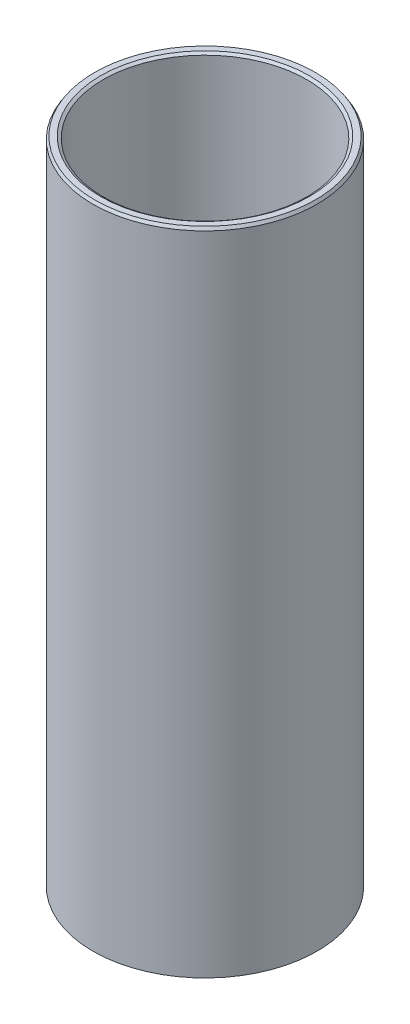
ISO-10303-21;
HEADER;
FILE_DESCRIPTION(('STEP AP214'),'2;1');
FILE_NAME('part.step','',(''),(''),'','','');
FILE_SCHEMA(('AUTOMOTIVE_DESIGN { 1 0 10303 214 1 1 1 1 }'));
ENDSEC;
DATA;
#1=APPLICATION_CONTEXT('core data for automotive mechanical design processes');
#2=APPLICATION_PROTOCOL_DEFINITION('international standard','automotive_design',2000,#1);
#3=PRODUCT_CONTEXT('',#1,'mechanical');
#4=PRODUCT('Part','Part','',(#3));
#5=PRODUCT_RELATED_PRODUCT_CATEGORY('part','',(#4));
#6=PRODUCT_DEFINITION_FORMATION('','',#4);
#7=PRODUCT_DEFINITION_CONTEXT('part definition',#1,'design');
#8=PRODUCT_DEFINITION('design','',#6,#7);
#9=PRODUCT_DEFINITION_SHAPE('','',#8);
#10=(LENGTH_UNIT() NAMED_UNIT(*) SI_UNIT(.MILLI.,.METRE.));
#11=(NAMED_UNIT(*) PLANE_ANGLE_UNIT() SI_UNIT($,.RADIAN.));
#12=(NAMED_UNIT(*) SI_UNIT($,.STERADIAN.) SOLID_ANGLE_UNIT());
#13=UNCERTAINTY_MEASURE_WITH_UNIT(LENGTH_MEASURE(1.E-05),#10,'distance_accuracy_value','');
#14=(GEOMETRIC_REPRESENTATION_CONTEXT(3) GLOBAL_UNCERTAINTY_ASSIGNED_CONTEXT((#13)) GLOBAL_UNIT_ASSIGNED_CONTEXT((#10,
#11,#12)) REPRESENTATION_CONTEXT('',''));
#15=CARTESIAN_POINT('',(0.,0.,0.));
#16=DIRECTION('',(0.,0.,1.));
#17=DIRECTION('',(1.,0.,0.));
#18=AXIS2_PLACEMENT_3D('',#15,#16,#17);
#19=CARTESIAN_POINT('',(0.,319.319546374463,0.));
#20=DIRECTION('',(0.,-1.,0.));
#21=DIRECTION('',(0.,0.,-1.));
#22=AXIS2_PLACEMENT_3D('',#19,#20,#21);
#23=CYLINDRICAL_SURFACE('',#22,55.);
#24=CARTESIAN_POINT('',(0.,0.891832323549224,0.));
#25=DIRECTION('',(0.,1.,0.));
#26=DIRECTION('',(0.,0.,1.));
#27=AXIS2_PLACEMENT_3D('',#24,#25,#26);
#28=CIRCLE('',#27,55.);
#29=CARTESIAN_POINT('',(0.,0.891832323549224,55.));
#30=VERTEX_POINT('',#29);
#31=EDGE_CURVE('E10',#30,#30,#28,.T.);
#32=ORIENTED_EDGE('',*,*,#31,.T.);
#33=EDGE_LOOP('',(#32));
#34=FACE_BOUND('',#33,.T.);
#35=CARTESIAN_POINT('',(0.,317.944861314462,0.));
#36=DIRECTION('',(0.,1.,0.));
#37=DIRECTION('',(0.,0.,1.));
#38=AXIS2_PLACEMENT_3D('',#35,#36,#37);
#39=CIRCLE('',#38,55.);
#40=CARTESIAN_POINT('',(0.,317.944861314462,55.));
#41=VERTEX_POINT('',#40);
#42=EDGE_CURVE('E50',#41,#41,#39,.F.);
#43=ORIENTED_EDGE('',*,*,#42,.T.);
#44=EDGE_LOOP('',(#43));
#45=FACE_BOUND('',#44,.T.);
#46=ADVANCED_FACE('F39',(#34,#45),#23,.T.);
#47=CARTESIAN_POINT('',(0.,319.319546374463,0.));
#48=DIRECTION('',(0.,1.,0.));
#49=DIRECTION('',(0.,0.,1.));
#50=AXIS2_PLACEMENT_3D('',#47,#48,#49);
#51=PLANE('',#50);
#52=CARTESIAN_POINT('',(0.,319.319546374463,0.));
#53=DIRECTION('',(0.,1.,0.));
#54=DIRECTION('',(0.,0.,1.));
#55=AXIS2_PLACEMENT_3D('',#52,#53,#54);
#56=CIRCLE('',#55,51.2301711558806);
#57=CARTESIAN_POINT('',(0.,319.319546374463,51.2301711558806));
#58=VERTEX_POINT('',#57);
#59=EDGE_CURVE('E58',#58,#58,#56,.F.);
#60=ORIENTED_EDGE('',*,*,#59,.T.);
#61=EDGE_LOOP('',(#60));
#62=FACE_BOUND('',#61,.T.);
#63=CARTESIAN_POINT('',(0.,319.319546374463,0.));
#64=DIRECTION('',(0.,1.,0.));
#65=DIRECTION('',(0.,0.,1.));
#66=AXIS2_PLACEMENT_3D('',#63,#64,#65);
#67=CIRCLE('',#66,54.1081676764508);
#68=CARTESIAN_POINT('',(0.,319.319546374463,54.1081676764508));
#69=VERTEX_POINT('',#68);
#70=EDGE_CURVE('E61',#69,#69,#67,.T.);
#71=ORIENTED_EDGE('',*,*,#70,.T.);
#72=EDGE_LOOP('',(#71));
#73=FACE_BOUND('',#72,.T.);
#74=ADVANCED_FACE('F88',(#62,#73),#51,.T.);
#75=CARTESIAN_POINT('',(0.,0.,0.));
#76=DIRECTION('',(0.,1.,0.));
#77=DIRECTION('',(0.,0.,1.));
#78=AXIS2_PLACEMENT_3D('',#75,#76,#77);
#79=PLANE('',#78);
#80=CARTESIAN_POINT('',(0.,0.,0.));
#81=DIRECTION('',(0.,1.,0.));
#82=DIRECTION('',(0.,0.,1.));
#83=AXIS2_PLACEMENT_3D('',#80,#81,#82);
#84=CIRCLE('',#83,50.7473184194286);
#85=CARTESIAN_POINT('',(0.,0.,50.7473184194286));
#86=VERTEX_POINT('',#85);
#87=EDGE_CURVE('E51',#86,#86,#84,.T.);
#88=ORIENTED_EDGE('',*,*,#87,.T.);
#89=EDGE_LOOP('',(#88));
#90=FACE_BOUND('',#89,.T.);
#91=CARTESIAN_POINT('',(0.,0.,0.));
#92=DIRECTION('',(0.,1.,0.));
#93=DIRECTION('',(0.,0.,1.));
#94=AXIS2_PLACEMENT_3D('',#91,#92,#93);
#95=CIRCLE('',#94,53.6253149399987);
#96=CARTESIAN_POINT('',(0.,0.,53.6253149399987));
#97=VERTEX_POINT('',#96);
#98=EDGE_CURVE('E54',#97,#97,#95,.F.);
#99=ORIENTED_EDGE('',*,*,#98,.T.);
#100=EDGE_LOOP('',(#99));
#101=FACE_BOUND('',#100,.T.);
#102=ADVANCED_FACE('F83',(#90,#101),#79,.F.);
#103=CARTESIAN_POINT('',(0.,319.319546374463,0.));
#104=DIRECTION('',(0.,-1.,0.));
#105=DIRECTION('',(0.,0.,-1.));
#106=AXIS2_PLACEMENT_3D('',#103,#104,#105);
#107=CYLINDRICAL_SURFACE('',#106,49.8554860958794);
#108=CARTESIAN_POINT('',(0.,318.427714050914,0.));
#109=DIRECTION('',(0.,1.,0.));
#110=DIRECTION('',(0.,0.,1.));
#111=AXIS2_PLACEMENT_3D('',#108,#109,#110);
#112=CIRCLE('',#111,49.8554860958794);
#113=CARTESIAN_POINT('',(0.,318.427714050914,49.8554860958794));
#114=VERTEX_POINT('',#113);
#115=EDGE_CURVE('E67',#114,#114,#112,.T.);
#116=ORIENTED_EDGE('',*,*,#115,.T.);
#117=EDGE_LOOP('',(#116));
#118=FACE_BOUND('',#117,.T.);
#119=CARTESIAN_POINT('',(0.,1.37468506000121,0.));
#120=DIRECTION('',(0.,1.,0.));
#121=DIRECTION('',(0.,0.,1.));
#122=AXIS2_PLACEMENT_3D('',#119,#120,#121);
#123=CIRCLE('',#122,49.8554860958794);
#124=CARTESIAN_POINT('',(0.,1.37468506000121,49.8554860958794));
#125=VERTEX_POINT('',#124);
#126=EDGE_CURVE('E69',#125,#125,#123,.F.);
#127=ORIENTED_EDGE('',*,*,#126,.T.);
#128=EDGE_LOOP('',(#127));
#129=FACE_BOUND('',#128,.T.);
#130=ADVANCED_FACE('F71',(#118,#129),#107,.F.);
#131=CARTESIAN_POINT('',(0.,318.427714050914,0.));
#132=DIRECTION('',(0.,1.,0.));
#133=DIRECTION('',(0.,0.,1.));
#134=AXIS2_PLACEMENT_3D('',#131,#132,#133);
#135=CONICAL_SURFACE('',#134,49.8554860958794,0.995297582865004);
#136=ORIENTED_EDGE('',*,*,#59,.F.);
#137=EDGE_LOOP('',(#136));
#138=FACE_BOUND('',#137,.T.);
#139=ORIENTED_EDGE('',*,*,#115,.F.);
#140=EDGE_LOOP('',(#139));
#141=FACE_BOUND('',#140,.T.);
#142=ADVANCED_FACE('F77',(#138,#141),#135,.F.);
#143=CARTESIAN_POINT('',(0.,0.,0.));
#144=DIRECTION('',(0.,-1.,0.));
#145=DIRECTION('',(0.,0.,-1.));
#146=AXIS2_PLACEMENT_3D('',#143,#144,#145);
#147=CONICAL_SURFACE('',#146,50.7473184194286,0.575498743929919);
#148=ORIENTED_EDGE('',*,*,#126,.F.);
#149=EDGE_LOOP('',(#148));
#150=FACE_BOUND('',#149,.T.);
#151=ORIENTED_EDGE('',*,*,#87,.F.);
#152=EDGE_LOOP('',(#151));
#153=FACE_BOUND('',#152,.T.);
#154=ADVANCED_FACE('F73',(#150,#153),#147,.F.);
#155=CARTESIAN_POINT('',(0.,0.891832323549224,0.));
#156=DIRECTION('',(0.,1.,0.));
#157=DIRECTION('',(0.,0.,1.));
#158=AXIS2_PLACEMENT_3D('',#155,#156,#157);
#159=CONICAL_SURFACE('',#158,55.,0.99529758286498);
#160=CARTESIAN_POINT('',(0.,0.,53.6253149399987));
#161=CARTESIAN_POINT('',(0.,0.00928992003696922,53.6396345760404));
#162=CARTESIAN_POINT('',(0.,0.0185798400739409,53.6539542120821));
#163=CARTESIAN_POINT('',(0.,0.0371596801478843,53.6825934841654));
#164=CARTESIAN_POINT('',(0.,0.046449600184856,53.6969131202071));
#165=CARTESIAN_POINT('',(0.,0.0650294402587979,53.7255523922905));
#166=CARTESIAN_POINT('',(0.,0.074319360295768,53.7398720283322));
#167=CARTESIAN_POINT('',(0.,0.0928992003697103,53.7685113004155));
#168=CARTESIAN_POINT('',(0.,0.102189120406682,53.7828309364572));
#169=CARTESIAN_POINT('',(0.,0.120768960480625,53.8114702085406));
#170=CARTESIAN_POINT('',(0.,0.130058880517595,53.8257898445822));
#171=CARTESIAN_POINT('',(0.,0.148638720591537,53.8544291166656));
#172=CARTESIAN_POINT('',(0.,0.157928640628509,53.8687487527073));
#173=CARTESIAN_POINT('',(0.,0.176508480702451,53.8973880247906));
#174=CARTESIAN_POINT('',(0.,0.185798400739421,53.9117076608323));
#175=CARTESIAN_POINT('',(0.,0.204378240813363,53.9403469329157));
#176=CARTESIAN_POINT('',(0.,0.213668160850335,53.9546665689574));
#177=CARTESIAN_POINT('',(0.,0.232248000924278,53.9833058410407));
#178=CARTESIAN_POINT('',(0.,0.241537920961248,53.9976254770824));
#179=CARTESIAN_POINT('',(0.,0.26011776103519,54.0262647491658));
#180=CARTESIAN_POINT('',(0.,0.269407681072162,54.0405843852074));
#181=CARTESIAN_POINT('',(0.,0.287987521146104,54.0692236572908));
#182=CARTESIAN_POINT('',(0.,0.297277441183074,54.0835432933325));
#183=CARTESIAN_POINT('',(0.,0.315857281257016,54.1121825654158));
#184=CARTESIAN_POINT('',(0.,0.325147201293988,54.1265022014575));
#185=CARTESIAN_POINT('',(0.,0.343727041367931,54.1551414735409));
#186=CARTESIAN_POINT('',(0.,0.353016961404901,54.1694611095826));
#187=CARTESIAN_POINT('',(0.,0.371596801478843,54.1981003816659));
#188=CARTESIAN_POINT('',(0.,0.380886721515815,54.2124200177076));
#189=CARTESIAN_POINT('',(0.,0.399466561589757,54.241059289791));
#190=CARTESIAN_POINT('',(0.,0.408756481626727,54.2553789258326));
#191=CARTESIAN_POINT('',(0.,0.427336321700669,54.284018197916));
#192=CARTESIAN_POINT('',(0.,0.436626241737641,54.2983378339577));
#193=CARTESIAN_POINT('',(0.,0.455206081811584,54.326977106041));
#194=CARTESIAN_POINT('',(0.,0.464496001848555,54.3412967420827));
#195=CARTESIAN_POINT('',(0.,0.483075841922496,54.3699360141661));
#196=CARTESIAN_POINT('',(0.,0.492365761959467,54.3842556502078));
#197=CARTESIAN_POINT('',(0.,0.510945602033409,54.4128949222911));
#198=CARTESIAN_POINT('',(0.,0.520235522070381,54.4272145583328));
#199=CARTESIAN_POINT('',(0.,0.538815362144323,54.4558538304162));
#200=CARTESIAN_POINT('',(0.,0.548105282181294,54.4701734664578));
#201=CARTESIAN_POINT('',(0.,0.566685122255236,54.4988127385412));
#202=CARTESIAN_POINT('',(0.,0.575975042292208,54.5131323745829));
#203=CARTESIAN_POINT('',(0.,0.59455488236615,54.5417716466662));
#204=CARTESIAN_POINT('',(0.,0.60384480240312,54.5560912827079));
#205=CARTESIAN_POINT('',(0.,0.622424642477062,54.5847305547913));
#206=CARTESIAN_POINT('',(0.,0.631714562514034,54.599050190833));
#207=CARTESIAN_POINT('',(0.,0.650294402587977,54.6276894629163));
#208=CARTESIAN_POINT('',(0.,0.659584322624947,54.642009098958));
#209=CARTESIAN_POINT('',(0.,0.678164162698889,54.6706483710414));
#210=CARTESIAN_POINT('',(0.,0.687454082735861,54.684968007083));
#211=CARTESIAN_POINT('',(0.,0.706033922809803,54.7136072791664));
#212=CARTESIAN_POINT('',(0.,0.715323842846773,54.7279269152081));
#213=CARTESIAN_POINT('',(0.,0.733903682920715,54.7565661872914));
#214=CARTESIAN_POINT('',(0.,0.743193602957687,54.7708858233331));
#215=CARTESIAN_POINT('',(0.,0.76177344303163,54.7995250954165));
#216=CARTESIAN_POINT('',(0.,0.7710633630686,54.8138447314582));
#217=CARTESIAN_POINT('',(0.,0.789643203142542,54.8424840035415));
#218=CARTESIAN_POINT('',(0.,0.798933123179514,54.8568036395832));
#219=CARTESIAN_POINT('',(0.,0.817512963253456,54.8854429116666));
#220=CARTESIAN_POINT('',(0.,0.826802883290426,54.8997625477082));
#221=CARTESIAN_POINT('',(0.,0.845382723364368,54.9284018197916));
#222=CARTESIAN_POINT('',(0.,0.85467264340134,54.9427214558333));
#223=CARTESIAN_POINT('',(0.,0.873252483475283,54.9713607279166));
#224=CARTESIAN_POINT('',(0.,0.882542403512255,54.9856803639583));
#225=CARTESIAN_POINT('',(0.,0.891832323549224,55.));
#226=B_SPLINE_CURVE_WITH_KNOTS('',3,(#160,#161,#162,#163,#164,#165,#166,#167,#168,#169,#170,
#171,#172,#173,#174,#175,#176,#177,#178,#179,#180,#181,#182,#183,#184,#185,#186,#187,#188,#189,
#190,#191,#192,#193,#194,#195,#196,#197,#198,#199,#200,#201,#202,#203,#204,#205,#206,#207,#208,
#209,#210,#211,#212,#213,#214,#215,#216,#217,#218,#219,#220,#221,#222,#223,#224,#225),
.UNSPECIFIED.,.F.,.F.,(4,2,2,2,2,2,2,2,2,2,2,2,2,2,2,2,2,2,2,2,2,2,2,2,2,2,2,2,2,2,2,2,4),(0.,
0.0512073365440514,0.102414673088097,0.153622009632149,0.204829346176194,0.256036682720246,
0.307244019264291,0.358451355808343,0.409658692352388,0.46086602889644,0.512073365440485,
0.563280701984537,0.614488038528582,0.665695375072634,0.71690271161668,0.768110048160731,
0.819317384704777,0.870524721248828,0.92173205779288,0.972939394336925,1.02414673088098,
1.07535406742502,1.12656140396907,1.17776874051312,1.22897607705717,1.28018341360122,
1.33139075014527,1.38259808668931,1.43380542323337,1.48501275977741,1.53622009632146,
1.58742743286551,1.63863476940956),.UNSPECIFIED.);
#227=EDGE_CURVE('BSEAM76',#97,#30,#226,.T.);
#228=ORIENTED_EDGE('',*,*,#98,.F.);
#229=ORIENTED_EDGE('',*,*,#31,.F.);
#230=ORIENTED_EDGE('',*,*,#227,.T.);
#231=ORIENTED_EDGE('',*,*,#227,.F.);
#232=EDGE_LOOP('',(#228,#230,#229,#231));
#233=FACE_BOUND('',#232,.T.);
#234=ADVANCED_FACE('F76',(#233),#159,.T.);
#235=CARTESIAN_POINT('',(0.,319.319546374463,0.));
#236=DIRECTION('',(0.,-1.,0.));
#237=DIRECTION('',(0.,0.,-1.));
#238=AXIS2_PLACEMENT_3D('',#235,#236,#237);
#239=CONICAL_SURFACE('',#238,54.1081676764508,0.575498743929912);
#240=ORIENTED_EDGE('',*,*,#42,.F.);
#241=EDGE_LOOP('',(#240));
#242=FACE_BOUND('',#241,.T.);
#243=ORIENTED_EDGE('',*,*,#70,.F.);
#244=EDGE_LOOP('',(#243));
#245=FACE_BOUND('',#244,.T.);
#246=ADVANCED_FACE('F45',(#242,#245),#239,.T.);
#247=CLOSED_SHELL('',(#46,#74,#102,#130,#142,#154,#234,#246));
#248=MANIFOLD_SOLID_BREP('B2',#247);
#249=ADVANCED_BREP_SHAPE_REPRESENTATION('',(#18,#248),#14);
#250=SHAPE_DEFINITION_REPRESENTATION(#9,#249);
ENDSEC;
END-ISO-10303-21;
